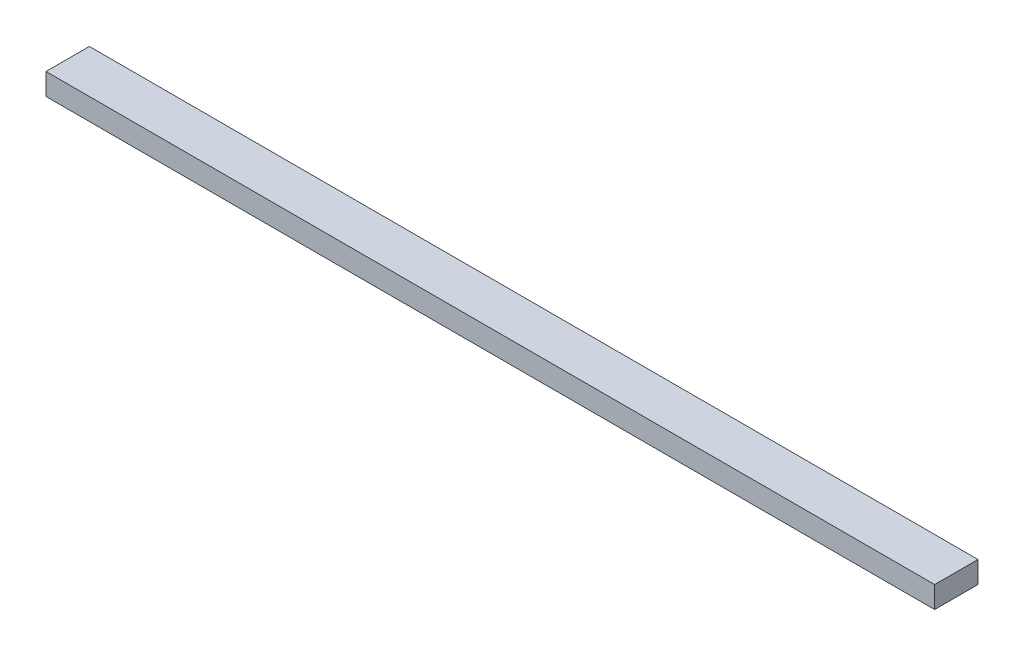
ISO-10303-21;
HEADER;
FILE_DESCRIPTION(('STEP AP214'),'2;1');
FILE_NAME('part.step','',(''),(''),'','','');
FILE_SCHEMA(('AUTOMOTIVE_DESIGN { 1 0 10303 214 1 1 1 1 }'));
ENDSEC;
DATA;
#1=APPLICATION_CONTEXT('core data for automotive mechanical design processes');
#2=APPLICATION_PROTOCOL_DEFINITION('international standard','automotive_design',2000,#1);
#3=PRODUCT_CONTEXT('',#1,'mechanical');
#4=PRODUCT('Part','Part','',(#3));
#5=PRODUCT_RELATED_PRODUCT_CATEGORY('part','',(#4));
#6=PRODUCT_DEFINITION_FORMATION('','',#4);
#7=PRODUCT_DEFINITION_CONTEXT('part definition',#1,'design');
#8=PRODUCT_DEFINITION('design','',#6,#7);
#9=PRODUCT_DEFINITION_SHAPE('','',#8);
#10=(LENGTH_UNIT() NAMED_UNIT(*) SI_UNIT(.MILLI.,.METRE.));
#11=(NAMED_UNIT(*) PLANE_ANGLE_UNIT() SI_UNIT($,.RADIAN.));
#12=(NAMED_UNIT(*) SI_UNIT($,.STERADIAN.) SOLID_ANGLE_UNIT());
#13=UNCERTAINTY_MEASURE_WITH_UNIT(LENGTH_MEASURE(1.E-05),#10,'distance_accuracy_value','');
#14=(GEOMETRIC_REPRESENTATION_CONTEXT(3) GLOBAL_UNCERTAINTY_ASSIGNED_CONTEXT((#13)) GLOBAL_UNIT_ASSIGNED_CONTEXT((#10,
#11,#12)) REPRESENTATION_CONTEXT('',''));
#15=CARTESIAN_POINT('',(0.,0.,0.));
#16=DIRECTION('',(0.,0.,1.));
#17=DIRECTION('',(1.,0.,0.));
#18=AXIS2_PLACEMENT_3D('',#15,#16,#17);
#19=CARTESIAN_POINT('',(-205.,10.,-9.99999999999998));
#20=DIRECTION('',(1.,0.,0.));
#21=DIRECTION('',(0.,0.,-1.));
#22=AXIS2_PLACEMENT_3D('',#19,#20,#21);
#23=PLANE('',#22);
#24=DIRECTION('',(0.,0.,1.));
#25=VECTOR('',#24,1.);
#26=CARTESIAN_POINT('',(-205.,0.,-9.99999999999998));
#27=LINE('',#26,#25);
#28=CARTESIAN_POINT('',(-205.,0.,-9.99999999999998));
#29=VERTEX_POINT('',#28);
#30=CARTESIAN_POINT('',(-205.,0.,10.));
#31=VERTEX_POINT('',#30);
#32=EDGE_CURVE('E95',#29,#31,#27,.T.);
#33=ORIENTED_EDGE('',*,*,#32,.T.);
#34=DIRECTION('',(0.,-1.,0.));
#35=VECTOR('',#34,1.);
#36=CARTESIAN_POINT('',(-205.,10.,10.));
#37=LINE('',#36,#35);
#38=CARTESIAN_POINT('',(-205.,10.,10.));
#39=VERTEX_POINT('',#38);
#40=EDGE_CURVE('E11',#39,#31,#37,.T.);
#41=ORIENTED_EDGE('',*,*,#40,.F.);
#42=DIRECTION('',(0.,0.,1.));
#43=VECTOR('',#42,1.);
#44=CARTESIAN_POINT('',(-205.,10.,-9.99999999999998));
#45=LINE('',#44,#43);
#46=CARTESIAN_POINT('',(-205.,10.,-9.99999999999998));
#47=VERTEX_POINT('',#46);
#48=EDGE_CURVE('E83',#47,#39,#45,.T.);
#49=ORIENTED_EDGE('',*,*,#48,.F.);
#50=DIRECTION('',(0.,-1.,0.));
#51=VECTOR('',#50,1.);
#52=CARTESIAN_POINT('',(-205.,10.,-9.99999999999998));
#53=LINE('',#52,#51);
#54=EDGE_CURVE('E91',#47,#29,#53,.T.);
#55=ORIENTED_EDGE('',*,*,#54,.T.);
#56=EDGE_LOOP('',(#33,#41,#49,#55));
#57=FACE_BOUND('',#56,.T.);
#58=ADVANCED_FACE('F32',(#57),#23,.F.);
#59=CARTESIAN_POINT('',(-205.,10.,10.));
#60=DIRECTION('',(0.,0.,-1.));
#61=DIRECTION('',(-1.,0.,0.));
#62=AXIS2_PLACEMENT_3D('',#59,#60,#61);
#63=PLANE('',#62);
#64=DIRECTION('',(1.,0.,0.));
#65=VECTOR('',#64,1.);
#66=CARTESIAN_POINT('',(-205.,0.,10.));
#67=LINE('',#66,#65);
#68=CARTESIAN_POINT('',(205.,0.,10.));
#69=VERTEX_POINT('',#68);
#70=EDGE_CURVE('E87',#31,#69,#67,.T.);
#71=ORIENTED_EDGE('',*,*,#70,.T.);
#72=DIRECTION('',(0.,-1.,0.));
#73=VECTOR('',#72,1.);
#74=CARTESIAN_POINT('',(205.,10.,10.));
#75=LINE('',#74,#73);
#76=CARTESIAN_POINT('',(205.,10.,10.));
#77=VERTEX_POINT('',#76);
#78=EDGE_CURVE('E40',#77,#69,#75,.T.);
#79=ORIENTED_EDGE('',*,*,#78,.F.);
#80=DIRECTION('',(1.,0.,0.));
#81=VECTOR('',#80,1.);
#82=CARTESIAN_POINT('',(-205.,10.,10.));
#83=LINE('',#82,#81);
#84=EDGE_CURVE('E78',#39,#77,#83,.T.);
#85=ORIENTED_EDGE('',*,*,#84,.F.);
#86=ORIENTED_EDGE('',*,*,#40,.T.);
#87=EDGE_LOOP('',(#71,#79,#85,#86));
#88=FACE_BOUND('',#87,.T.);
#89=ADVANCED_FACE('F86',(#88),#63,.F.);
#90=CARTESIAN_POINT('',(205.,10.,-9.99999999999998));
#91=DIRECTION('',(-1.,0.,0.));
#92=DIRECTION('',(0.,0.,1.));
#93=AXIS2_PLACEMENT_3D('',#90,#91,#92);
#94=PLANE('',#93);
#95=DIRECTION('',(0.,0.,-1.));
#96=VECTOR('',#95,1.);
#97=CARTESIAN_POINT('',(205.,0.,-9.99999999999998));
#98=LINE('',#97,#96);
#99=CARTESIAN_POINT('',(205.,0.,-9.99999999999998));
#100=VERTEX_POINT('',#99);
#101=EDGE_CURVE('E65',#69,#100,#98,.T.);
#102=ORIENTED_EDGE('',*,*,#101,.T.);
#103=DIRECTION('',(0.,-1.,0.));
#104=VECTOR('',#103,1.);
#105=CARTESIAN_POINT('',(205.,10.,-9.99999999999998));
#106=LINE('',#105,#104);
#107=CARTESIAN_POINT('',(205.,10.,-9.99999999999998));
#108=VERTEX_POINT('',#107);
#109=EDGE_CURVE('E88',#108,#100,#106,.T.);
#110=ORIENTED_EDGE('',*,*,#109,.F.);
#111=DIRECTION('',(0.,0.,-1.));
#112=VECTOR('',#111,1.);
#113=CARTESIAN_POINT('',(205.,10.,-9.99999999999998));
#114=LINE('',#113,#112);
#115=EDGE_CURVE('E81',#77,#108,#114,.T.);
#116=ORIENTED_EDGE('',*,*,#115,.F.);
#117=ORIENTED_EDGE('',*,*,#78,.T.);
#118=EDGE_LOOP('',(#102,#110,#116,#117));
#119=FACE_BOUND('',#118,.T.);
#120=ADVANCED_FACE('F89',(#119),#94,.F.);
#121=CARTESIAN_POINT('',(-205.,10.,-9.99999999999998));
#122=DIRECTION('',(0.,0.,1.));
#123=DIRECTION('',(1.,0.,0.));
#124=AXIS2_PLACEMENT_3D('',#121,#122,#123);
#125=PLANE('',#124);
#126=DIRECTION('',(-1.,0.,0.));
#127=VECTOR('',#126,1.);
#128=CARTESIAN_POINT('',(-205.,0.,-9.99999999999998));
#129=LINE('',#128,#127);
#130=EDGE_CURVE('E71',#100,#29,#129,.T.);
#131=ORIENTED_EDGE('',*,*,#130,.T.);
#132=ORIENTED_EDGE('',*,*,#54,.F.);
#133=DIRECTION('',(-1.,0.,0.));
#134=VECTOR('',#133,1.);
#135=CARTESIAN_POINT('',(-205.,10.,-9.99999999999998));
#136=LINE('',#135,#134);
#137=EDGE_CURVE('E48',#108,#47,#136,.T.);
#138=ORIENTED_EDGE('',*,*,#137,.F.);
#139=ORIENTED_EDGE('',*,*,#109,.T.);
#140=EDGE_LOOP('',(#131,#132,#138,#139));
#141=FACE_BOUND('',#140,.T.);
#142=ADVANCED_FACE('F102',(#141),#125,.F.);
#143=CARTESIAN_POINT('',(0.,10.,0.));
#144=DIRECTION('',(0.,1.,0.));
#145=DIRECTION('',(0.,0.,1.));
#146=AXIS2_PLACEMENT_3D('',#143,#144,#145);
#147=PLANE('',#146);
#148=ORIENTED_EDGE('',*,*,#48,.T.);
#149=ORIENTED_EDGE('',*,*,#84,.T.);
#150=ORIENTED_EDGE('',*,*,#115,.T.);
#151=ORIENTED_EDGE('',*,*,#137,.T.);
#152=EDGE_LOOP('',(#148,#149,#150,#151));
#153=FACE_BOUND('',#152,.T.);
#154=ADVANCED_FACE('F79',(#153),#147,.T.);
#155=CARTESIAN_POINT('',(0.,0.,0.));
#156=DIRECTION('',(0.,1.,0.));
#157=DIRECTION('',(0.,0.,1.));
#158=AXIS2_PLACEMENT_3D('',#155,#156,#157);
#159=PLANE('',#158);
#160=ORIENTED_EDGE('',*,*,#32,.F.);
#161=ORIENTED_EDGE('',*,*,#130,.F.);
#162=ORIENTED_EDGE('',*,*,#101,.F.);
#163=ORIENTED_EDGE('',*,*,#70,.F.);
#164=EDGE_LOOP('',(#160,#161,#162,#163));
#165=FACE_BOUND('',#164,.T.);
#166=ADVANCED_FACE('F105',(#165),#159,.F.);
#167=CLOSED_SHELL('',(#58,#89,#120,#142,#154,#166));
#168=MANIFOLD_SOLID_BREP('B2',#167);
#169=ADVANCED_BREP_SHAPE_REPRESENTATION('',(#18,#168),#14);
#170=SHAPE_DEFINITION_REPRESENTATION(#9,#169);
ENDSEC;
END-ISO-10303-21;
